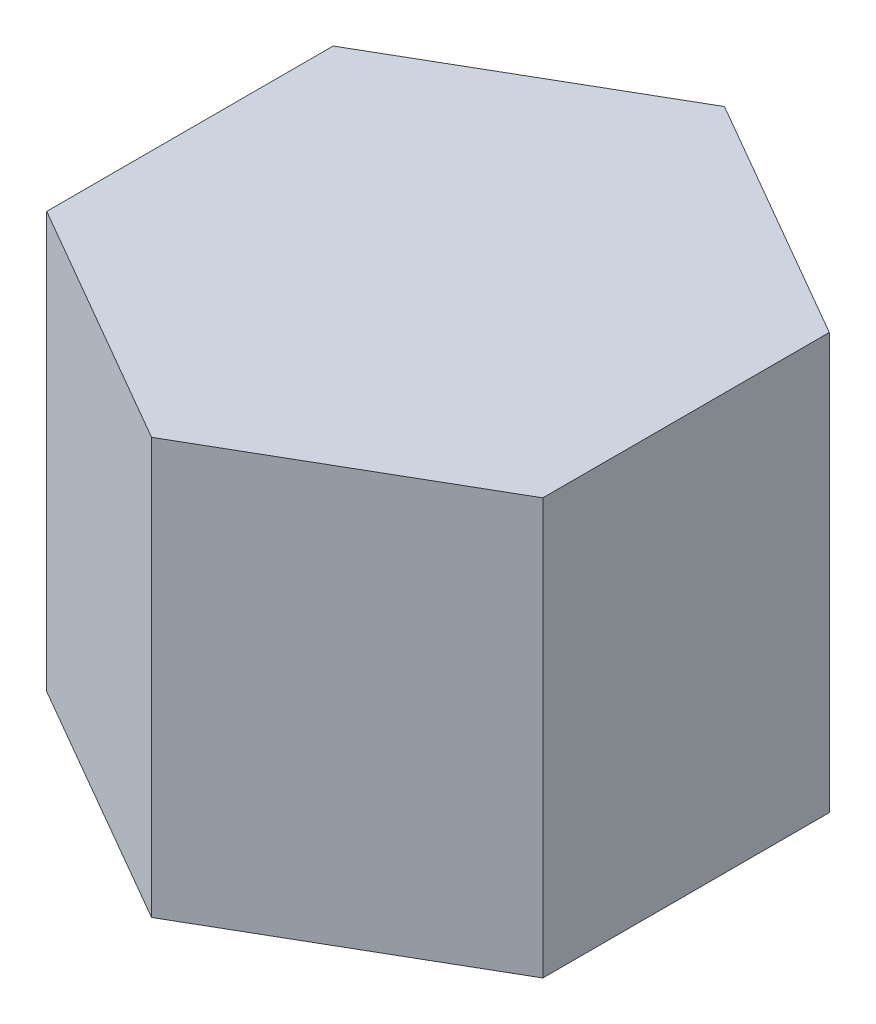
ISO-10303-21;
HEADER;
FILE_DESCRIPTION(('STEP AP214'),'2;1');
FILE_NAME('part.step','',(''),(''),'','','');
FILE_SCHEMA(('AUTOMOTIVE_DESIGN { 1 0 10303 214 1 1 1 1 }'));
ENDSEC;
DATA;
#1=APPLICATION_CONTEXT('core data for automotive mechanical design processes');
#2=APPLICATION_PROTOCOL_DEFINITION('international standard','automotive_design',2000,#1);
#3=PRODUCT_CONTEXT('',#1,'mechanical');
#4=PRODUCT('Part','Part','',(#3));
#5=PRODUCT_RELATED_PRODUCT_CATEGORY('part','',(#4));
#6=PRODUCT_DEFINITION_FORMATION('','',#4);
#7=PRODUCT_DEFINITION_CONTEXT('part definition',#1,'design');
#8=PRODUCT_DEFINITION('design','',#6,#7);
#9=PRODUCT_DEFINITION_SHAPE('','',#8);
#10=(LENGTH_UNIT() NAMED_UNIT(*) SI_UNIT(.MILLI.,.METRE.));
#11=(NAMED_UNIT(*) PLANE_ANGLE_UNIT() SI_UNIT($,.RADIAN.));
#12=(NAMED_UNIT(*) SI_UNIT($,.STERADIAN.) SOLID_ANGLE_UNIT());
#13=UNCERTAINTY_MEASURE_WITH_UNIT(LENGTH_MEASURE(1.E-05),#10,'distance_accuracy_value','');
#14=(GEOMETRIC_REPRESENTATION_CONTEXT(3) GLOBAL_UNCERTAINTY_ASSIGNED_CONTEXT((#13)) GLOBAL_UNIT_ASSIGNED_CONTEXT((#10,
#11,#12)) REPRESENTATION_CONTEXT('',''));
#15=CARTESIAN_POINT('',(0.,0.,0.));
#16=DIRECTION('',(0.,0.,1.));
#17=DIRECTION('',(1.,0.,0.));
#18=AXIS2_PLACEMENT_3D('',#15,#16,#17);
#19=CARTESIAN_POINT('',(204.142660308706,-148.537700895744,292.372996624279));
#20=DIRECTION('',(-0.499999999999909,0.,-0.866025403784491));
#21=DIRECTION('',(-0.866025403784491,0.,0.499999999999909));
#22=AXIS2_PLACEMENT_3D('',#19,#20,#21);
#23=PLANE('',#22);
#24=CARTESIAN_POINT('',(203.839551417382,-149.045793579175,292.547996624279));
#25=DIRECTION('',(0.866025403784491,0.,-0.499999999999909));
#26=VECTOR('',#25,1.);
#27=LINE('',#24,#26);
#28=CARTESIAN_POINT('',(203.839551417382,-149.045793579175,292.547996624279));
#29=VERTEX_POINT('',#28);
#30=CARTESIAN_POINT('',(204.142660308706,-149.045793579175,292.372996624279));
#31=VERTEX_POINT('',#30);
#32=EDGE_CURVE('E170',#29,#31,#27,.T.);
#33=ORIENTED_EDGE('',*,*,#32,.T.);
#34=CARTESIAN_POINT('',(204.142660308706,-148.537700895744,292.372996624279));
#35=DIRECTION('',(0.,-1.,0.));
#36=VECTOR('',#35,1.);
#37=LINE('',#34,#36);
#38=CARTESIAN_POINT('',(204.142660308706,-148.537700895744,292.372996624279));
#39=VERTEX_POINT('',#38);
#40=EDGE_CURVE('E35',#39,#31,#37,.T.);
#41=ORIENTED_EDGE('',*,*,#40,.F.);
#42=CARTESIAN_POINT('',(203.839551417382,-148.537700895744,292.547996624279));
#43=DIRECTION('',(0.866025403784491,0.,-0.499999999999909));
#44=VECTOR('',#43,1.);
#45=LINE('',#42,#44);
#46=CARTESIAN_POINT('',(203.839551417382,-148.537700895744,292.547996624279));
#47=VERTEX_POINT('',#46);
#48=EDGE_CURVE('E159',#47,#39,#45,.T.);
#49=ORIENTED_EDGE('',*,*,#48,.F.);
#50=CARTESIAN_POINT('',(203.839551417382,-148.537700895744,292.547996624279));
#51=DIRECTION('',(0.,-1.,0.));
#52=VECTOR('',#51,1.);
#53=LINE('',#50,#52);
#54=EDGE_CURVE('E10',#47,#29,#53,.T.);
#55=ORIENTED_EDGE('',*,*,#54,.T.);
#56=EDGE_LOOP('',(#33,#41,#49,#55));
#57=FACE_BOUND('',#56,.T.);
#58=ADVANCED_FACE('F16',(#57),#23,.F.);
#59=CARTESIAN_POINT('',(203.839551417382,-148.537700895744,292.547996624279));
#60=DIRECTION('',(0.500000000000062,0.,-0.866025403784403));
#61=DIRECTION('',(-0.866025403784403,0.,-0.500000000000062));
#62=AXIS2_PLACEMENT_3D('',#59,#60,#61);
#63=PLANE('',#62);
#64=CARTESIAN_POINT('',(203.536442526057,-149.045793579175,292.372996624279));
#65=DIRECTION('',(0.866025403784403,0.,0.500000000000062));
#66=VECTOR('',#65,1.);
#67=LINE('',#64,#66);
#68=CARTESIAN_POINT('',(203.536442526057,-149.045793579175,292.372996624279));
#69=VERTEX_POINT('',#68);
#70=EDGE_CURVE('E167',#69,#29,#67,.T.);
#71=ORIENTED_EDGE('',*,*,#70,.T.);
#72=ORIENTED_EDGE('',*,*,#54,.F.);
#73=CARTESIAN_POINT('',(203.536442526057,-148.537700895744,292.372996624279));
#74=DIRECTION('',(0.866025403784403,0.,0.500000000000062));
#75=VECTOR('',#74,1.);
#76=LINE('',#73,#75);
#77=CARTESIAN_POINT('',(203.536442526057,-148.537700895744,292.372996624279));
#78=VERTEX_POINT('',#77);
#79=EDGE_CURVE('E156',#78,#47,#76,.T.);
#80=ORIENTED_EDGE('',*,*,#79,.F.);
#81=CARTESIAN_POINT('',(203.536442526057,-148.537700895744,292.372996624279));
#82=DIRECTION('',(0.,-1.,0.));
#83=VECTOR('',#82,1.);
#84=LINE('',#81,#83);
#85=EDGE_CURVE('E27',#78,#69,#84,.T.);
#86=ORIENTED_EDGE('',*,*,#85,.T.);
#87=EDGE_LOOP('',(#71,#72,#80,#86));
#88=FACE_BOUND('',#87,.T.);
#89=ADVANCED_FACE('F189',(#88),#63,.F.);
#90=CARTESIAN_POINT('',(203.536442526057,-148.537700895744,290.831971220494));
#91=DIRECTION('',(1.,0.,0.));
#92=DIRECTION('',(0.,1.,0.));
#93=AXIS2_PLACEMENT_3D('',#90,#91,#92);
#94=PLANE('',#93);
#95=CARTESIAN_POINT('',(203.536442526057,-149.045793579175,292.022996624279));
#96=DIRECTION('',(0.,0.,1.));
#97=VECTOR('',#96,1.);
#98=LINE('',#95,#97);
#99=CARTESIAN_POINT('',(203.536442526057,-149.045793579175,292.022996624279));
#100=VERTEX_POINT('',#99);
#101=EDGE_CURVE('E163',#100,#69,#98,.T.);
#102=ORIENTED_EDGE('',*,*,#101,.T.);
#103=ORIENTED_EDGE('',*,*,#85,.F.);
#104=CARTESIAN_POINT('',(203.536442526057,-148.537700895744,292.022996624279));
#105=DIRECTION('',(0.,0.,1.));
#106=VECTOR('',#105,1.);
#107=LINE('',#104,#106);
#108=CARTESIAN_POINT('',(203.536442526057,-148.537700895744,292.022996624279));
#109=VERTEX_POINT('',#108);
#110=EDGE_CURVE('E106',#109,#78,#107,.T.);
#111=ORIENTED_EDGE('',*,*,#110,.F.);
#112=CARTESIAN_POINT('',(203.536442526057,-148.537700895744,292.022996624279));
#113=DIRECTION('',(0.,-1.,0.));
#114=VECTOR('',#113,1.);
#115=LINE('',#112,#114);
#116=EDGE_CURVE('E94',#109,#100,#115,.T.);
#117=ORIENTED_EDGE('',*,*,#116,.T.);
#118=EDGE_LOOP('',(#102,#103,#111,#117));
#119=FACE_BOUND('',#118,.T.);
#120=ADVANCED_FACE('F198',(#119),#94,.F.);
#121=CARTESIAN_POINT('',(203.536442526057,-148.537700895744,292.022996624279));
#122=DIRECTION('',(0.499999999999943,0.,0.866025403784472));
#123=DIRECTION('',(0.866025403784472,0.,-0.499999999999943));
#124=AXIS2_PLACEMENT_3D('',#121,#122,#123);
#125=PLANE('',#124);
#126=CARTESIAN_POINT('',(203.839551417382,-149.045793579175,291.847996624279));
#127=DIRECTION('',(-0.866025403784471,0.,0.499999999999943));
#128=VECTOR('',#127,1.);
#129=LINE('',#126,#128);
#130=CARTESIAN_POINT('',(203.839551417382,-149.045793579175,291.847996624279));
#131=VERTEX_POINT('',#130);
#132=EDGE_CURVE('E162',#131,#100,#129,.T.);
#133=ORIENTED_EDGE('',*,*,#132,.T.);
#134=ORIENTED_EDGE('',*,*,#116,.F.);
#135=CARTESIAN_POINT('',(203.839551417382,-148.537700895744,291.847996624279));
#136=DIRECTION('',(-0.866025403784471,0.,0.499999999999943));
#137=VECTOR('',#136,1.);
#138=LINE('',#135,#137);
#139=CARTESIAN_POINT('',(203.839551417382,-148.537700895744,291.847996624279));
#140=VERTEX_POINT('',#139);
#141=EDGE_CURVE('E98',#140,#109,#138,.T.);
#142=ORIENTED_EDGE('',*,*,#141,.F.);
#143=CARTESIAN_POINT('',(203.839551417382,-148.537700895744,291.847996624279));
#144=DIRECTION('',(0.,-1.,0.));
#145=VECTOR('',#144,1.);
#146=LINE('',#143,#145);
#147=EDGE_CURVE('E79',#140,#131,#146,.T.);
#148=ORIENTED_EDGE('',*,*,#147,.T.);
#149=EDGE_LOOP('',(#133,#134,#142,#148));
#150=FACE_BOUND('',#149,.T.);
#151=ADVANCED_FACE('F100',(#150),#125,.F.);
#152=CARTESIAN_POINT('',(203.839551417381,-148.537700895744,291.847996624279));
#153=DIRECTION('',(-0.500000000000062,0.,0.866025403784403));
#154=DIRECTION('',(0.866025403784403,0.,0.500000000000062));
#155=AXIS2_PLACEMENT_3D('',#152,#153,#154);
#156=PLANE('',#155);
#157=CARTESIAN_POINT('',(204.142660308706,-149.045793579175,292.022996624279));
#158=DIRECTION('',(-0.866025403784403,0.,-0.500000000000062));
#159=VECTOR('',#158,1.);
#160=LINE('',#157,#159);
#161=CARTESIAN_POINT('',(204.142660308706,-149.045793579175,292.022996624279));
#162=VERTEX_POINT('',#161);
#163=EDGE_CURVE('E88',#162,#131,#160,.T.);
#164=ORIENTED_EDGE('',*,*,#163,.T.);
#165=ORIENTED_EDGE('',*,*,#147,.F.);
#166=CARTESIAN_POINT('',(204.142660308706,-148.537700895744,292.022996624279));
#167=DIRECTION('',(-0.866025403784403,0.,-0.500000000000062));
#168=VECTOR('',#167,1.);
#169=LINE('',#166,#168);
#170=CARTESIAN_POINT('',(204.142660308706,-148.537700895744,292.022996624279));
#171=VERTEX_POINT('',#170);
#172=EDGE_CURVE('E84',#171,#140,#169,.T.);
#173=ORIENTED_EDGE('',*,*,#172,.F.);
#174=CARTESIAN_POINT('',(204.142660308706,-148.537700895744,292.022996624279));
#175=DIRECTION('',(0.,-1.,0.));
#176=VECTOR('',#175,1.);
#177=LINE('',#174,#176);
#178=EDGE_CURVE('E58',#171,#162,#177,.T.);
#179=ORIENTED_EDGE('',*,*,#178,.T.);
#180=EDGE_LOOP('',(#164,#165,#173,#179));
#181=FACE_BOUND('',#180,.T.);
#182=ADVANCED_FACE('F82',(#181),#156,.F.);
#183=CARTESIAN_POINT('',(204.142660308706,-148.537700895744,290.831971220494));
#184=DIRECTION('',(-1.,0.,0.));
#185=DIRECTION('',(0.,-1.,0.));
#186=AXIS2_PLACEMENT_3D('',#183,#184,#185);
#187=PLANE('',#186);
#188=CARTESIAN_POINT('',(204.142660308706,-149.045793579175,292.372996624279));
#189=DIRECTION('',(0.,0.,-1.));
#190=VECTOR('',#189,1.);
#191=LINE('',#188,#190);
#192=EDGE_CURVE('E160',#31,#162,#191,.T.);
#193=ORIENTED_EDGE('',*,*,#192,.T.);
#194=ORIENTED_EDGE('',*,*,#178,.F.);
#195=CARTESIAN_POINT('',(204.142660308706,-148.537700895744,292.372996624279));
#196=DIRECTION('',(0.,0.,-1.));
#197=VECTOR('',#196,1.);
#198=LINE('',#195,#197);
#199=EDGE_CURVE('E112',#39,#171,#198,.T.);
#200=ORIENTED_EDGE('',*,*,#199,.F.);
#201=ORIENTED_EDGE('',*,*,#40,.T.);
#202=EDGE_LOOP('',(#193,#194,#200,#201));
#203=FACE_BOUND('',#202,.T.);
#204=ADVANCED_FACE('F131',(#203),#187,.F.);
#205=CARTESIAN_POINT('',(206.339551417382,-148.537700895744,290.831971220494));
#206=DIRECTION('',(0.,-1.,0.));
#207=DIRECTION('',(1.,0.,0.));
#208=AXIS2_PLACEMENT_3D('',#205,#206,#207);
#209=PLANE('',#208);
#210=ORIENTED_EDGE('',*,*,#48,.T.);
#211=ORIENTED_EDGE('',*,*,#199,.T.);
#212=ORIENTED_EDGE('',*,*,#172,.T.);
#213=ORIENTED_EDGE('',*,*,#141,.T.);
#214=ORIENTED_EDGE('',*,*,#110,.T.);
#215=ORIENTED_EDGE('',*,*,#79,.T.);
#216=EDGE_LOOP('',(#210,#211,#212,#213,#214,#215));
#217=FACE_BOUND('',#216,.T.);
#218=ADVANCED_FACE('F111',(#217),#209,.F.);
#219=CARTESIAN_POINT('',(206.339551417382,-149.045793579175,290.831971220494));
#220=DIRECTION('',(0.,-1.,0.));
#221=DIRECTION('',(1.,0.,0.));
#222=AXIS2_PLACEMENT_3D('',#219,#220,#221);
#223=PLANE('',#222);
#224=ORIENTED_EDGE('',*,*,#32,.F.);
#225=ORIENTED_EDGE('',*,*,#70,.F.);
#226=ORIENTED_EDGE('',*,*,#101,.F.);
#227=ORIENTED_EDGE('',*,*,#132,.F.);
#228=ORIENTED_EDGE('',*,*,#163,.F.);
#229=ORIENTED_EDGE('',*,*,#192,.F.);
#230=EDGE_LOOP('',(#224,#225,#226,#227,#228,#229));
#231=FACE_BOUND('',#230,.T.);
#232=ADVANCED_FACE('F130',(#231),#223,.T.);
#233=CLOSED_SHELL('',(#58,#89,#120,#151,#182,#204,#218,#232));
#234=MANIFOLD_SOLID_BREP('B1',#233);
#235=ADVANCED_BREP_SHAPE_REPRESENTATION('',(#18,#234),#14);
#236=SHAPE_DEFINITION_REPRESENTATION(#9,#235);
ENDSEC;
END-ISO-10303-21;
